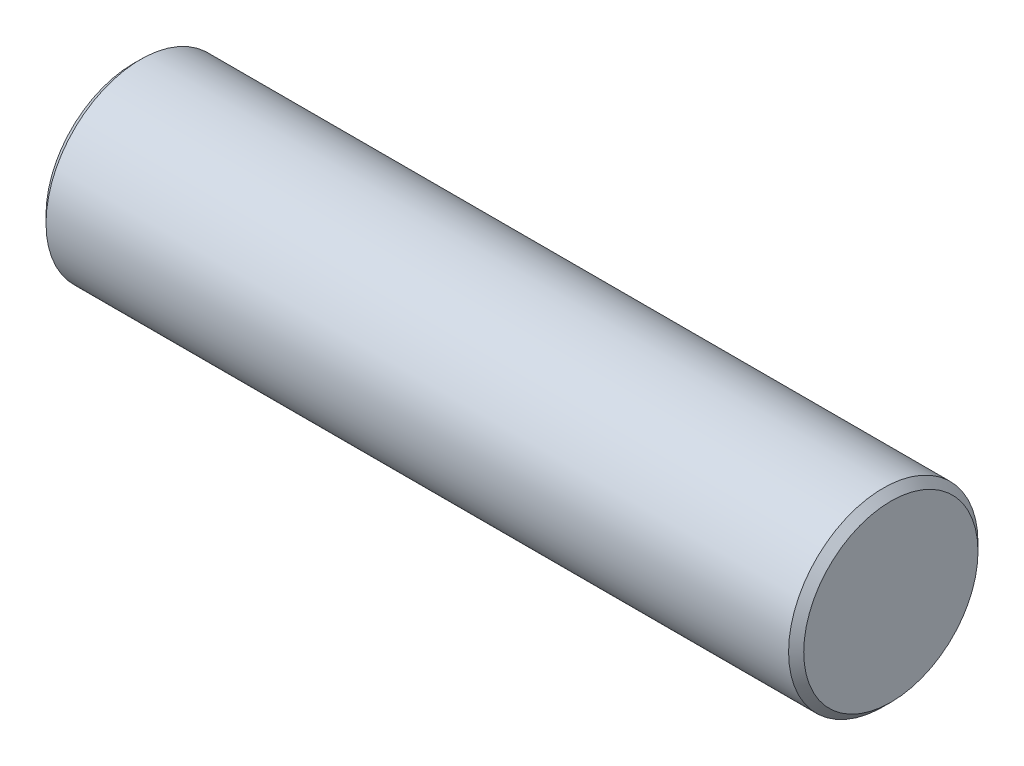
ISO-10303-21;
HEADER;
FILE_DESCRIPTION(('STEP AP214'),'2;1');
FILE_NAME('part.step','',(''),(''),'','','');
FILE_SCHEMA(('AUTOMOTIVE_DESIGN { 1 0 10303 214 1 1 1 1 }'));
ENDSEC;
DATA;
#1=APPLICATION_CONTEXT('core data for automotive mechanical design processes');
#2=APPLICATION_PROTOCOL_DEFINITION('international standard','automotive_design',2000,#1);
#3=PRODUCT_CONTEXT('',#1,'mechanical');
#4=PRODUCT('Part','Part','',(#3));
#5=PRODUCT_RELATED_PRODUCT_CATEGORY('part','',(#4));
#6=PRODUCT_DEFINITION_FORMATION('','',#4);
#7=PRODUCT_DEFINITION_CONTEXT('part definition',#1,'design');
#8=PRODUCT_DEFINITION('design','',#6,#7);
#9=PRODUCT_DEFINITION_SHAPE('','',#8);
#10=(LENGTH_UNIT() NAMED_UNIT(*) SI_UNIT(.MILLI.,.METRE.));
#11=(NAMED_UNIT(*) PLANE_ANGLE_UNIT() SI_UNIT($,.RADIAN.));
#12=(NAMED_UNIT(*) SI_UNIT($,.STERADIAN.) SOLID_ANGLE_UNIT());
#13=UNCERTAINTY_MEASURE_WITH_UNIT(LENGTH_MEASURE(1.E-05),#10,'distance_accuracy_value','');
#14=(GEOMETRIC_REPRESENTATION_CONTEXT(3) GLOBAL_UNCERTAINTY_ASSIGNED_CONTEXT((#13)) GLOBAL_UNIT_ASSIGNED_CONTEXT((#10,
#11,#12)) REPRESENTATION_CONTEXT('',''));
#15=CARTESIAN_POINT('',(0.,0.,0.));
#16=DIRECTION('',(0.,0.,1.));
#17=DIRECTION('',(1.,0.,0.));
#18=AXIS2_PLACEMENT_3D('',#15,#16,#17);
#19=CARTESIAN_POINT('',(12.7,0.,0.));
#20=DIRECTION('',(-1.,0.,0.));
#21=DIRECTION('',(0.,0.,1.));
#22=AXIS2_PLACEMENT_3D('',#19,#20,#21);
#23=CYLINDRICAL_SURFACE('',#22,3.175);
#24=CARTESIAN_POINT('',(12.446,0.,0.));
#25=DIRECTION('',(1.,0.,0.));
#26=DIRECTION('',(0.,0.,-1.));
#27=AXIS2_PLACEMENT_3D('',#24,#25,#26);
#28=CIRCLE('',#27,3.175);
#29=CARTESIAN_POINT('',(12.446,0.,-3.175));
#30=VERTEX_POINT('',#29);
#31=EDGE_CURVE('E40',#30,#30,#28,.F.);
#32=ORIENTED_EDGE('',*,*,#31,.T.);
#33=EDGE_LOOP('',(#32));
#34=FACE_BOUND('',#33,.T.);
#35=CARTESIAN_POINT('',(-12.446,0.,0.));
#36=DIRECTION('',(1.,0.,0.));
#37=DIRECTION('',(0.,0.,-1.));
#38=AXIS2_PLACEMENT_3D('',#35,#36,#37);
#39=CIRCLE('',#38,3.175);
#40=CARTESIAN_POINT('',(-12.446,0.,-3.175));
#41=VERTEX_POINT('',#40);
#42=EDGE_CURVE('E44',#41,#41,#39,.T.);
#43=ORIENTED_EDGE('',*,*,#42,.T.);
#44=EDGE_LOOP('',(#43));
#45=FACE_BOUND('',#44,.T.);
#46=ADVANCED_FACE('F33',(#34,#45),#23,.T.);
#47=CARTESIAN_POINT('',(12.7,0.,0.));
#48=DIRECTION('',(1.,0.,0.));
#49=DIRECTION('',(0.,0.,-1.));
#50=AXIS2_PLACEMENT_3D('',#47,#48,#49);
#51=PLANE('',#50);
#52=CARTESIAN_POINT('',(12.7,0.,0.));
#53=DIRECTION('',(1.,0.,0.));
#54=DIRECTION('',(0.,0.,-1.));
#55=AXIS2_PLACEMENT_3D('',#52,#53,#54);
#56=CIRCLE('',#55,2.921);
#57=CARTESIAN_POINT('',(12.7,0.,-2.921));
#58=VERTEX_POINT('',#57);
#59=EDGE_CURVE('E48',#58,#58,#56,.T.);
#60=ORIENTED_EDGE('',*,*,#59,.T.);
#61=EDGE_LOOP('',(#60));
#62=FACE_BOUND('',#61,.T.);
#63=ADVANCED_FACE('F54',(#62),#51,.T.);
#64=CARTESIAN_POINT('',(-12.7,0.,0.));
#65=DIRECTION('',(1.,0.,0.));
#66=DIRECTION('',(0.,0.,-1.));
#67=AXIS2_PLACEMENT_3D('',#64,#65,#66);
#68=PLANE('',#67);
#69=CARTESIAN_POINT('',(-12.7,0.,0.));
#70=DIRECTION('',(1.,0.,0.));
#71=DIRECTION('',(0.,0.,-1.));
#72=AXIS2_PLACEMENT_3D('',#69,#70,#71);
#73=CIRCLE('',#72,2.921);
#74=CARTESIAN_POINT('',(-12.7,0.,-2.921));
#75=VERTEX_POINT('',#74);
#76=EDGE_CURVE('E10',#75,#75,#73,.F.);
#77=ORIENTED_EDGE('',*,*,#76,.T.);
#78=EDGE_LOOP('',(#77));
#79=FACE_BOUND('',#78,.T.);
#80=ADVANCED_FACE('F58',(#79),#68,.F.);
#81=CARTESIAN_POINT('',(12.7,0.,0.));
#82=DIRECTION('',(-1.,0.,0.));
#83=DIRECTION('',(0.,0.,1.));
#84=AXIS2_PLACEMENT_3D('',#81,#82,#83);
#85=CONICAL_SURFACE('',#84,2.921,0.785398163397445);
#86=ORIENTED_EDGE('',*,*,#31,.F.);
#87=EDGE_LOOP('',(#86));
#88=FACE_BOUND('',#87,.T.);
#89=ORIENTED_EDGE('',*,*,#59,.F.);
#90=EDGE_LOOP('',(#89));
#91=FACE_BOUND('',#90,.T.);
#92=ADVANCED_FACE('F56',(#88,#91),#85,.T.);
#93=CARTESIAN_POINT('',(-12.446,0.,0.));
#94=DIRECTION('',(1.,0.,0.));
#95=DIRECTION('',(0.,0.,-1.));
#96=AXIS2_PLACEMENT_3D('',#93,#94,#95);
#97=CONICAL_SURFACE('',#96,3.175,0.785398163397457);
#98=ORIENTED_EDGE('',*,*,#76,.F.);
#99=EDGE_LOOP('',(#98));
#100=FACE_BOUND('',#99,.T.);
#101=ORIENTED_EDGE('',*,*,#42,.F.);
#102=EDGE_LOOP('',(#101));
#103=FACE_BOUND('',#102,.T.);
#104=ADVANCED_FACE('F35',(#100,#103),#97,.T.);
#105=CLOSED_SHELL('',(#46,#63,#80,#92,#104));
#106=MANIFOLD_SOLID_BREP('B2',#105);
#107=ADVANCED_BREP_SHAPE_REPRESENTATION('',(#18,#106),#14);
#108=SHAPE_DEFINITION_REPRESENTATION(#9,#107);
ENDSEC;
END-ISO-10303-21;
